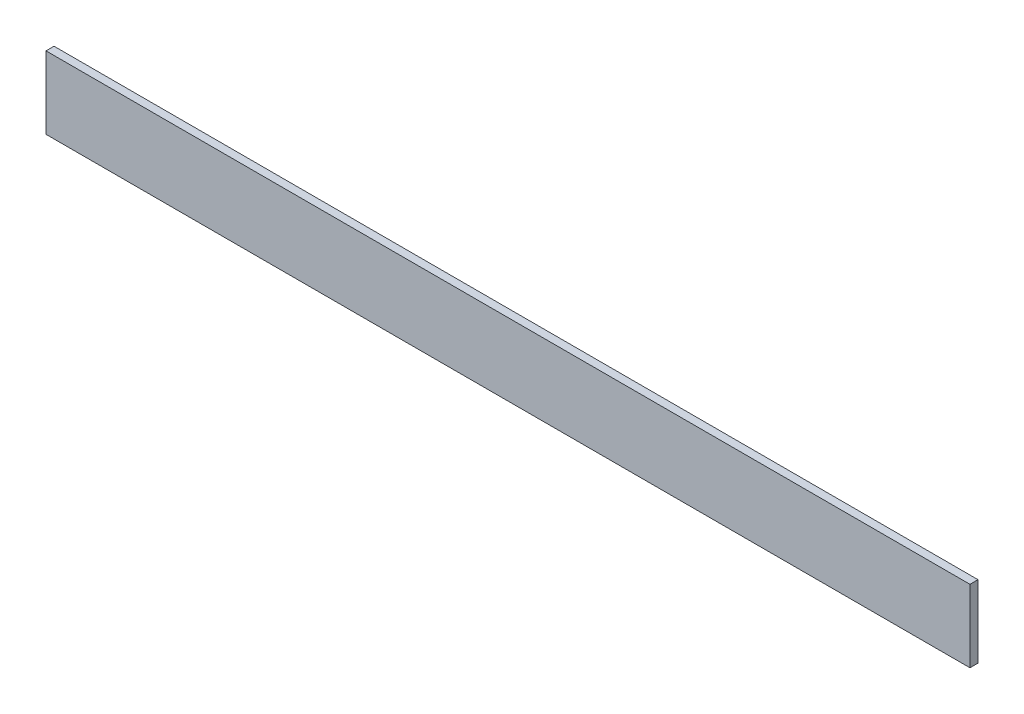
ISO-10303-21;
HEADER;
FILE_DESCRIPTION(('STEP AP214'),'2;1');
FILE_NAME('part.step','',(''),(''),'','','');
FILE_SCHEMA(('AUTOMOTIVE_DESIGN { 1 0 10303 214 1 1 1 1 }'));
ENDSEC;
DATA;
#1=APPLICATION_CONTEXT('core data for automotive mechanical design processes');
#2=APPLICATION_PROTOCOL_DEFINITION('international standard','automotive_design',2000,#1);
#3=PRODUCT_CONTEXT('',#1,'mechanical');
#4=PRODUCT('Part','Part','',(#3));
#5=PRODUCT_RELATED_PRODUCT_CATEGORY('part','',(#4));
#6=PRODUCT_DEFINITION_FORMATION('','',#4);
#7=PRODUCT_DEFINITION_CONTEXT('part definition',#1,'design');
#8=PRODUCT_DEFINITION('design','',#6,#7);
#9=PRODUCT_DEFINITION_SHAPE('','',#8);
#10=(LENGTH_UNIT() NAMED_UNIT(*) SI_UNIT(.MILLI.,.METRE.));
#11=(NAMED_UNIT(*) PLANE_ANGLE_UNIT() SI_UNIT($,.RADIAN.));
#12=(NAMED_UNIT(*) SI_UNIT($,.STERADIAN.) SOLID_ANGLE_UNIT());
#13=UNCERTAINTY_MEASURE_WITH_UNIT(LENGTH_MEASURE(1.E-05),#10,'distance_accuracy_value','');
#14=(GEOMETRIC_REPRESENTATION_CONTEXT(3) GLOBAL_UNCERTAINTY_ASSIGNED_CONTEXT((#13)) GLOBAL_UNIT_ASSIGNED_CONTEXT((#10,
#11,#12)) REPRESENTATION_CONTEXT('',''));
#15=CARTESIAN_POINT('',(0.,0.,0.));
#16=DIRECTION('',(0.,0.,1.));
#17=DIRECTION('',(1.,0.,0.));
#18=AXIS2_PLACEMENT_3D('',#15,#16,#17);
#19=CARTESIAN_POINT('',(-1150.,89.9999999999998,10.));
#20=DIRECTION('',(1.,0.,0.));
#21=DIRECTION('',(0.,0.,-1.));
#22=AXIS2_PLACEMENT_3D('',#19,#20,#21);
#23=PLANE('',#22);
#24=DIRECTION('',(0.,-1.,0.));
#25=VECTOR('',#24,1.);
#26=CARTESIAN_POINT('',(-1150.,89.9999999999998,-10.));
#27=LINE('',#26,#25);
#28=CARTESIAN_POINT('',(-1150.,89.9999999999998,-10.));
#29=VERTEX_POINT('',#28);
#30=CARTESIAN_POINT('',(-1150.,-90.0000000000002,-10.));
#31=VERTEX_POINT('',#30);
#32=EDGE_CURVE('E113',#29,#31,#27,.T.);
#33=ORIENTED_EDGE('',*,*,#32,.T.);
#34=DIRECTION('',(0.,0.,-1.));
#35=VECTOR('',#34,1.);
#36=CARTESIAN_POINT('',(-1150.,-90.0000000000002,10.));
#37=LINE('',#36,#35);
#38=CARTESIAN_POINT('',(-1150.,-90.0000000000002,10.));
#39=VERTEX_POINT('',#38);
#40=EDGE_CURVE('E11',#39,#31,#37,.T.);
#41=ORIENTED_EDGE('',*,*,#40,.F.);
#42=DIRECTION('',(0.,-1.,0.));
#43=VECTOR('',#42,1.);
#44=CARTESIAN_POINT('',(-1150.,89.9999999999998,10.));
#45=LINE('',#44,#43);
#46=CARTESIAN_POINT('',(-1150.,89.9999999999998,10.));
#47=VERTEX_POINT('',#46);
#48=EDGE_CURVE('E97',#47,#39,#45,.T.);
#49=ORIENTED_EDGE('',*,*,#48,.F.);
#50=DIRECTION('',(0.,0.,-1.));
#51=VECTOR('',#50,1.);
#52=CARTESIAN_POINT('',(-1150.,89.9999999999998,10.));
#53=LINE('',#52,#51);
#54=EDGE_CURVE('E109',#47,#29,#53,.T.);
#55=ORIENTED_EDGE('',*,*,#54,.T.);
#56=EDGE_LOOP('',(#33,#41,#49,#55));
#57=FACE_BOUND('',#56,.T.);
#58=ADVANCED_FACE('F45',(#57),#23,.F.);
#59=CARTESIAN_POINT('',(1150.,-89.9999999999999,10.));
#60=DIRECTION('',(0.,1.,0.));
#61=DIRECTION('',(-1.,0.,0.));
#62=AXIS2_PLACEMENT_3D('',#59,#60,#61);
#63=PLANE('',#62);
#64=DIRECTION('',(1.,0.,0.));
#65=VECTOR('',#64,1.);
#66=CARTESIAN_POINT('',(1150.,-89.9999999999999,-10.));
#67=LINE('',#66,#65);
#68=CARTESIAN_POINT('',(1150.,-89.9999999999999,-10.));
#69=VERTEX_POINT('',#68);
#70=EDGE_CURVE('E102',#31,#69,#67,.T.);
#71=ORIENTED_EDGE('',*,*,#70,.T.);
#72=DIRECTION('',(0.,0.,-1.));
#73=VECTOR('',#72,1.);
#74=CARTESIAN_POINT('',(1150.,-89.9999999999999,10.));
#75=LINE('',#74,#73);
#76=CARTESIAN_POINT('',(1150.,-89.9999999999999,10.));
#77=VERTEX_POINT('',#76);
#78=EDGE_CURVE('E54',#77,#69,#75,.T.);
#79=ORIENTED_EDGE('',*,*,#78,.F.);
#80=DIRECTION('',(1.,0.,0.));
#81=VECTOR('',#80,1.);
#82=CARTESIAN_POINT('',(1150.,-89.9999999999999,10.));
#83=LINE('',#82,#81);
#84=EDGE_CURVE('E92',#39,#77,#83,.T.);
#85=ORIENTED_EDGE('',*,*,#84,.F.);
#86=ORIENTED_EDGE('',*,*,#40,.T.);
#87=EDGE_LOOP('',(#71,#79,#85,#86));
#88=FACE_BOUND('',#87,.T.);
#89=ADVANCED_FACE('F101',(#88),#63,.F.);
#90=CARTESIAN_POINT('',(1150.,90.0000000000001,10.));
#91=DIRECTION('',(-1.,0.,0.));
#92=DIRECTION('',(0.,0.,1.));
#93=AXIS2_PLACEMENT_3D('',#90,#91,#92);
#94=PLANE('',#93);
#95=DIRECTION('',(0.,1.,0.));
#96=VECTOR('',#95,1.);
#97=CARTESIAN_POINT('',(1150.,90.0000000000001,-10.));
#98=LINE('',#97,#96);
#99=CARTESIAN_POINT('',(1150.,90.0000000000001,-10.));
#100=VERTEX_POINT('',#99);
#101=EDGE_CURVE('E79',#69,#100,#98,.T.);
#102=ORIENTED_EDGE('',*,*,#101,.T.);
#103=DIRECTION('',(0.,0.,-1.));
#104=VECTOR('',#103,1.);
#105=CARTESIAN_POINT('',(1150.,90.0000000000001,10.));
#106=LINE('',#105,#104);
#107=CARTESIAN_POINT('',(1150.,90.0000000000001,10.));
#108=VERTEX_POINT('',#107);
#109=EDGE_CURVE('E104',#108,#100,#106,.T.);
#110=ORIENTED_EDGE('',*,*,#109,.F.);
#111=DIRECTION('',(0.,1.,0.));
#112=VECTOR('',#111,1.);
#113=CARTESIAN_POINT('',(1150.,90.0000000000001,10.));
#114=LINE('',#113,#112);
#115=EDGE_CURVE('E95',#77,#108,#114,.T.);
#116=ORIENTED_EDGE('',*,*,#115,.F.);
#117=ORIENTED_EDGE('',*,*,#78,.T.);
#118=EDGE_LOOP('',(#102,#110,#116,#117));
#119=FACE_BOUND('',#118,.T.);
#120=ADVANCED_FACE('F105',(#119),#94,.F.);
#121=CARTESIAN_POINT('',(1150.,90.0000000000001,10.));
#122=DIRECTION('',(0.,-1.,0.));
#123=DIRECTION('',(1.,0.,0.));
#124=AXIS2_PLACEMENT_3D('',#121,#122,#123);
#125=PLANE('',#124);
#126=DIRECTION('',(-1.,0.,0.));
#127=VECTOR('',#126,1.);
#128=CARTESIAN_POINT('',(1150.,90.0000000000001,-10.));
#129=LINE('',#128,#127);
#130=EDGE_CURVE('E85',#100,#29,#129,.T.);
#131=ORIENTED_EDGE('',*,*,#130,.T.);
#132=ORIENTED_EDGE('',*,*,#54,.F.);
#133=DIRECTION('',(-1.,0.,0.));
#134=VECTOR('',#133,1.);
#135=CARTESIAN_POINT('',(1150.,90.0000000000001,10.));
#136=LINE('',#135,#134);
#137=EDGE_CURVE('E62',#108,#47,#136,.T.);
#138=ORIENTED_EDGE('',*,*,#137,.F.);
#139=ORIENTED_EDGE('',*,*,#109,.T.);
#140=EDGE_LOOP('',(#131,#132,#138,#139));
#141=FACE_BOUND('',#140,.T.);
#142=ADVANCED_FACE('F126',(#141),#125,.F.);
#143=CARTESIAN_POINT('',(0.,0.,10.));
#144=DIRECTION('',(0.,0.,-1.));
#145=DIRECTION('',(-1.,0.,0.));
#146=AXIS2_PLACEMENT_3D('',#143,#144,#145);
#147=PLANE('',#146);
#148=ORIENTED_EDGE('',*,*,#48,.T.);
#149=ORIENTED_EDGE('',*,*,#84,.T.);
#150=ORIENTED_EDGE('',*,*,#115,.T.);
#151=ORIENTED_EDGE('',*,*,#137,.T.);
#152=EDGE_LOOP('',(#148,#149,#150,#151));
#153=FACE_BOUND('',#152,.T.);
#154=ADVANCED_FACE('F93',(#153),#147,.F.);
#155=CARTESIAN_POINT('',(0.,0.,-10.));
#156=DIRECTION('',(0.,0.,-1.));
#157=DIRECTION('',(-1.,0.,0.));
#158=AXIS2_PLACEMENT_3D('',#155,#156,#157);
#159=PLANE('',#158);
#160=ORIENTED_EDGE('',*,*,#32,.F.);
#161=ORIENTED_EDGE('',*,*,#130,.F.);
#162=ORIENTED_EDGE('',*,*,#101,.F.);
#163=ORIENTED_EDGE('',*,*,#70,.F.);
#164=EDGE_LOOP('',(#160,#161,#162,#163));
#165=FACE_BOUND('',#164,.T.);
#166=ADVANCED_FACE('F129',(#165),#159,.T.);
#167=CLOSED_SHELL('',(#58,#89,#120,#142,#154,#166));
#168=MANIFOLD_SOLID_BREP('B2',#167);
#169=ADVANCED_BREP_SHAPE_REPRESENTATION('',(#18,#168),#14);
#170=SHAPE_DEFINITION_REPRESENTATION(#9,#169);
ENDSEC;
END-ISO-10303-21;
